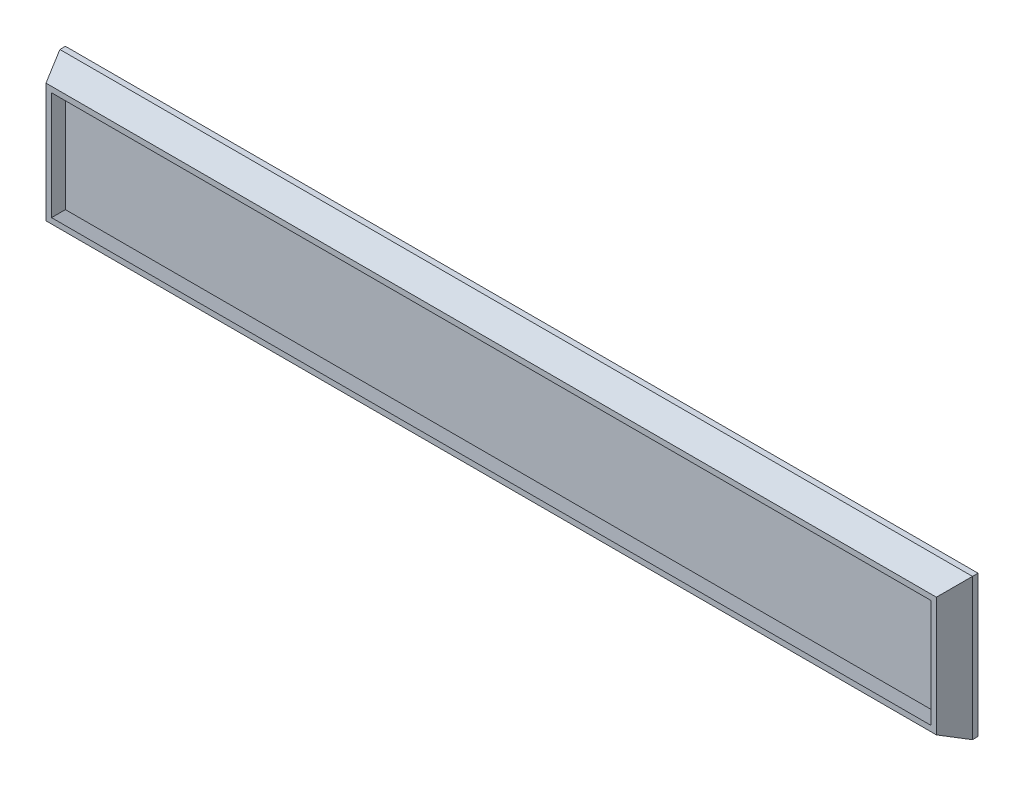
ISO-10303-21;
HEADER;
FILE_DESCRIPTION(('STEP AP214'),'2;1');
FILE_NAME('part.step','',(''),(''),'','','');
FILE_SCHEMA(('AUTOMOTIVE_DESIGN { 1 0 10303 214 1 1 1 1 }'));
ENDSEC;
DATA;
#1=APPLICATION_CONTEXT('core data for automotive mechanical design processes');
#2=APPLICATION_PROTOCOL_DEFINITION('international standard','automotive_design',2000,#1);
#3=PRODUCT_CONTEXT('',#1,'mechanical');
#4=PRODUCT('Part','Part','',(#3));
#5=PRODUCT_RELATED_PRODUCT_CATEGORY('part','',(#4));
#6=PRODUCT_DEFINITION_FORMATION('','',#4);
#7=PRODUCT_DEFINITION_CONTEXT('part definition',#1,'design');
#8=PRODUCT_DEFINITION('design','',#6,#7);
#9=PRODUCT_DEFINITION_SHAPE('','',#8);
#10=(LENGTH_UNIT() NAMED_UNIT(*) SI_UNIT(.MILLI.,.METRE.));
#11=(NAMED_UNIT(*) PLANE_ANGLE_UNIT() SI_UNIT($,.RADIAN.));
#12=(NAMED_UNIT(*) SI_UNIT($,.STERADIAN.) SOLID_ANGLE_UNIT());
#13=UNCERTAINTY_MEASURE_WITH_UNIT(LENGTH_MEASURE(1.E-05),#10,'distance_accuracy_value','');
#14=(GEOMETRIC_REPRESENTATION_CONTEXT(3) GLOBAL_UNCERTAINTY_ASSIGNED_CONTEXT((#13)) GLOBAL_UNIT_ASSIGNED_CONTEXT((#10,
#11,#12)) REPRESENTATION_CONTEXT('',''));
#15=CARTESIAN_POINT('',(0.,0.,0.));
#16=DIRECTION('',(0.,0.,1.));
#17=DIRECTION('',(1.,0.,0.));
#18=AXIS2_PLACEMENT_3D('',#15,#16,#17);
#19=CARTESIAN_POINT('',(82.25,-12.75,1.));
#20=DIRECTION('',(-1.,0.,0.));
#21=DIRECTION('',(0.,0.,1.));
#22=AXIS2_PLACEMENT_3D('',#19,#20,#21);
#23=PLANE('',#22);
#24=DIRECTION('',(0.,1.,0.));
#25=VECTOR('',#24,1.);
#26=CARTESIAN_POINT('',(82.25,-12.75,0.));
#27=LINE('',#26,#25);
#28=CARTESIAN_POINT('',(82.25,-12.75,0.));
#29=VERTEX_POINT('',#28);
#30=CARTESIAN_POINT('',(82.25,12.75,0.));
#31=VERTEX_POINT('',#30);
#32=EDGE_CURVE('E134',#29,#31,#27,.T.);
#33=ORIENTED_EDGE('',*,*,#32,.T.);
#34=DIRECTION('',(0.,0.,-1.));
#35=VECTOR('',#34,1.);
#36=CARTESIAN_POINT('',(82.25,12.75,1.));
#37=LINE('',#36,#35);
#38=CARTESIAN_POINT('',(82.25,12.75,0.999999999999992));
#39=VERTEX_POINT('',#38);
#40=EDGE_CURVE('E12',#39,#31,#37,.T.);
#41=ORIENTED_EDGE('',*,*,#40,.F.);
#42=DIRECTION('',(0.,1.,0.));
#43=VECTOR('',#42,1.);
#44=CARTESIAN_POINT('',(82.25,0.,0.999999999999984));
#45=LINE('',#44,#43);
#46=CARTESIAN_POINT('',(82.25,-12.75,0.999999999999993));
#47=VERTEX_POINT('',#46);
#48=EDGE_CURVE('E92',#47,#39,#45,.T.);
#49=ORIENTED_EDGE('',*,*,#48,.F.);
#50=DIRECTION('',(0.,0.,-1.));
#51=VECTOR('',#50,1.);
#52=CARTESIAN_POINT('',(82.25,-12.75,1.));
#53=LINE('',#52,#51);
#54=EDGE_CURVE('E551',#47,#29,#53,.T.);
#55=ORIENTED_EDGE('',*,*,#54,.T.);
#56=EDGE_LOOP('',(#33,#41,#49,#55));
#57=FACE_BOUND('',#56,.T.);
#58=ADVANCED_FACE('F51',(#57),#23,.F.);
#59=CARTESIAN_POINT('',(-82.25,12.75,1.));
#60=DIRECTION('',(0.,-1.,0.));
#61=DIRECTION('',(0.,0.,-1.));
#62=AXIS2_PLACEMENT_3D('',#59,#60,#61);
#63=PLANE('',#62);
#64=DIRECTION('',(-1.,0.,0.));
#65=VECTOR('',#64,1.);
#66=CARTESIAN_POINT('',(-82.25,12.75,0.));
#67=LINE('',#66,#65);
#68=CARTESIAN_POINT('',(-82.25,12.75,0.));
#69=VERTEX_POINT('',#68);
#70=EDGE_CURVE('E546',#31,#69,#67,.T.);
#71=ORIENTED_EDGE('',*,*,#70,.T.);
#72=DIRECTION('',(0.,0.,-1.));
#73=VECTOR('',#72,1.);
#74=CARTESIAN_POINT('',(-82.25,12.75,1.));
#75=LINE('',#74,#73);
#76=CARTESIAN_POINT('',(-82.25,12.75,0.999999999999992));
#77=VERTEX_POINT('',#76);
#78=EDGE_CURVE('E60',#77,#69,#75,.T.);
#79=ORIENTED_EDGE('',*,*,#78,.F.);
#80=DIRECTION('',(1.,0.,0.));
#81=VECTOR('',#80,1.);
#82=CARTESIAN_POINT('',(0.,12.75,0.999999999999997));
#83=LINE('',#82,#81);
#84=EDGE_CURVE('E124',#39,#77,#83,.F.);
#85=ORIENTED_EDGE('',*,*,#84,.F.);
#86=ORIENTED_EDGE('',*,*,#40,.T.);
#87=EDGE_LOOP('',(#71,#79,#85,#86));
#88=FACE_BOUND('',#87,.T.);
#89=ADVANCED_FACE('F125',(#88),#63,.F.);
#90=CARTESIAN_POINT('',(-82.25,-12.75,1.));
#91=DIRECTION('',(1.,0.,0.));
#92=DIRECTION('',(0.,0.,-1.));
#93=AXIS2_PLACEMENT_3D('',#90,#91,#92);
#94=PLANE('',#93);
#95=DIRECTION('',(0.,-1.,0.));
#96=VECTOR('',#95,1.);
#97=CARTESIAN_POINT('',(-82.25,-12.75,0.));
#98=LINE('',#97,#96);
#99=CARTESIAN_POINT('',(-82.25,-12.75,0.));
#100=VERTEX_POINT('',#99);
#101=EDGE_CURVE('E548',#69,#100,#98,.T.);
#102=ORIENTED_EDGE('',*,*,#101,.T.);
#103=DIRECTION('',(0.,0.,-1.));
#104=VECTOR('',#103,1.);
#105=CARTESIAN_POINT('',(-82.25,-12.75,1.));
#106=LINE('',#105,#104);
#107=CARTESIAN_POINT('',(-82.25,-12.75,0.999999999999993));
#108=VERTEX_POINT('',#107);
#109=EDGE_CURVE('E78',#108,#100,#106,.T.);
#110=ORIENTED_EDGE('',*,*,#109,.F.);
#111=DIRECTION('',(0.,1.,0.));
#112=VECTOR('',#111,1.);
#113=CARTESIAN_POINT('',(-82.25,0.,0.999999999999984));
#114=LINE('',#113,#112);
#115=EDGE_CURVE('E131',#77,#108,#114,.F.);
#116=ORIENTED_EDGE('',*,*,#115,.F.);
#117=ORIENTED_EDGE('',*,*,#78,.T.);
#118=EDGE_LOOP('',(#102,#110,#116,#117));
#119=FACE_BOUND('',#118,.T.);
#120=ADVANCED_FACE('F185',(#119),#94,.F.);
#121=CARTESIAN_POINT('',(-82.25,-12.75,1.));
#122=DIRECTION('',(0.,1.,0.));
#123=DIRECTION('',(0.,0.,1.));
#124=AXIS2_PLACEMENT_3D('',#121,#122,#123);
#125=PLANE('',#124);
#126=DIRECTION('',(1.,0.,0.));
#127=VECTOR('',#126,1.);
#128=CARTESIAN_POINT('',(-82.25,-12.75,0.));
#129=LINE('',#128,#127);
#130=EDGE_CURVE('E120',#100,#29,#129,.T.);
#131=ORIENTED_EDGE('',*,*,#130,.T.);
#132=ORIENTED_EDGE('',*,*,#54,.F.);
#133=DIRECTION('',(1.,0.,0.));
#134=VECTOR('',#133,1.);
#135=CARTESIAN_POINT('',(0.,-12.75,0.999999999999998));
#136=LINE('',#135,#134);
#137=EDGE_CURVE('E553',#108,#47,#136,.T.);
#138=ORIENTED_EDGE('',*,*,#137,.F.);
#139=ORIENTED_EDGE('',*,*,#109,.T.);
#140=EDGE_LOOP('',(#131,#132,#138,#139));
#141=FACE_BOUND('',#140,.T.);
#142=ADVANCED_FACE('F181',(#141),#125,.F.);
#143=CARTESIAN_POINT('',(0.,0.,0.));
#144=DIRECTION('',(0.,0.,-1.));
#145=DIRECTION('',(-1.,0.,0.));
#146=AXIS2_PLACEMENT_3D('',#143,#144,#145);
#147=PLANE('',#146);
#148=ORIENTED_EDGE('',*,*,#32,.F.);
#149=ORIENTED_EDGE('',*,*,#130,.F.);
#150=ORIENTED_EDGE('',*,*,#101,.F.);
#151=ORIENTED_EDGE('',*,*,#70,.F.);
#152=EDGE_LOOP('',(#148,#149,#150,#151));
#153=FACE_BOUND('',#152,.T.);
#154=ADVANCED_FACE('F177',(#153),#147,.T.);
#155=CARTESIAN_POINT('',(0.,0.,5.5));
#156=DIRECTION('',(0.,0.,1.));
#157=DIRECTION('',(1.,0.,0.));
#158=AXIS2_PLACEMENT_3D('',#155,#156,#157);
#159=PLANE('',#158);
#160=DIRECTION('',(0.,-1.,0.));
#161=VECTOR('',#160,1.);
#162=CARTESIAN_POINT('',(-79.25,9.75,5.5));
#163=LINE('',#162,#161);
#164=CARTESIAN_POINT('',(-79.25,9.75,5.5));
#165=VERTEX_POINT('',#164);
#166=CARTESIAN_POINT('',(-79.25,-9.75,5.5));
#167=VERTEX_POINT('',#166);
#168=EDGE_CURVE('E54',#165,#167,#163,.T.);
#169=ORIENTED_EDGE('',*,*,#168,.F.);
#170=DIRECTION('',(-1.,0.,0.));
#171=VECTOR('',#170,1.);
#172=CARTESIAN_POINT('',(79.25,9.75000000000003,5.5));
#173=LINE('',#172,#171);
#174=CARTESIAN_POINT('',(79.25,9.75000000000003,5.5));
#175=VERTEX_POINT('',#174);
#176=EDGE_CURVE('E418',#175,#165,#173,.T.);
#177=ORIENTED_EDGE('',*,*,#176,.F.);
#178=DIRECTION('',(0.,1.,0.));
#179=VECTOR('',#178,1.);
#180=CARTESIAN_POINT('',(79.25,-9.74999999999998,5.5));
#181=LINE('',#180,#179);
#182=CARTESIAN_POINT('',(79.25,-9.74999999999998,5.5));
#183=VERTEX_POINT('',#182);
#184=EDGE_CURVE('E405',#183,#175,#181,.T.);
#185=ORIENTED_EDGE('',*,*,#184,.F.);
#186=DIRECTION('',(1.,0.,0.));
#187=VECTOR('',#186,1.);
#188=CARTESIAN_POINT('',(-79.25,-9.74999999999999,5.5));
#189=LINE('',#188,#187);
#190=EDGE_CURVE('E68',#167,#183,#189,.T.);
#191=ORIENTED_EDGE('',*,*,#190,.F.);
#192=EDGE_LOOP('',(#169,#177,#185,#191));
#193=FACE_BOUND('',#192,.T.);
#194=DIRECTION('',(0.,-1.,0.));
#195=VECTOR('',#194,1.);
#196=CARTESIAN_POINT('',(-80.25,10.75,5.5));
#197=LINE('',#196,#195);
#198=CARTESIAN_POINT('',(-80.25,10.75,5.5));
#199=VERTEX_POINT('',#198);
#200=CARTESIAN_POINT('',(-80.25,-10.75,5.5));
#201=VERTEX_POINT('',#200);
#202=EDGE_CURVE('E397',#199,#201,#197,.T.);
#203=ORIENTED_EDGE('',*,*,#202,.T.);
#204=DIRECTION('',(1.,0.,0.));
#205=VECTOR('',#204,1.);
#206=CARTESIAN_POINT('',(-80.25,-10.75,5.5));
#207=LINE('',#206,#205);
#208=CARTESIAN_POINT('',(80.25,-10.75,5.5));
#209=VERTEX_POINT('',#208);
#210=EDGE_CURVE('E482',#201,#209,#207,.T.);
#211=ORIENTED_EDGE('',*,*,#210,.T.);
#212=DIRECTION('',(0.,1.,0.));
#213=VECTOR('',#212,1.);
#214=CARTESIAN_POINT('',(80.25,-10.75,5.5));
#215=LINE('',#214,#213);
#216=CARTESIAN_POINT('',(80.25,10.75,5.5));
#217=VERTEX_POINT('',#216);
#218=EDGE_CURVE('E104',#209,#217,#215,.T.);
#219=ORIENTED_EDGE('',*,*,#218,.T.);
#220=DIRECTION('',(-1.,0.,0.));
#221=VECTOR('',#220,1.);
#222=CARTESIAN_POINT('',(80.25,10.75,5.5));
#223=LINE('',#222,#221);
#224=EDGE_CURVE('E143',#217,#199,#223,.T.);
#225=ORIENTED_EDGE('',*,*,#224,.T.);
#226=EDGE_LOOP('',(#203,#211,#219,#225));
#227=FACE_BOUND('',#226,.T.);
#228=ADVANCED_FACE('F180',(#193,#227),#159,.T.);
#229=CARTESIAN_POINT('',(-69.0541237113402,0.,30.6907216494846));
#230=DIRECTION('',(-0.913811548620257,0.,0.406138466053448));
#231=DIRECTION('',(0.406138466053448,0.,0.913811548620257));
#232=AXIS2_PLACEMENT_3D('',#229,#230,#231);
#233=PLANE('',#232);
#234=DIRECTION('',(-0.376288347353439,0.376288347353439,-0.846648781545237));
#235=VECTOR('',#234,1.);
#236=CARTESIAN_POINT('',(-80.25,10.75,5.5));
#237=LINE('',#236,#235);
#238=EDGE_CURVE('E149',#199,#77,#237,.T.);
#239=ORIENTED_EDGE('',*,*,#238,.T.);
#240=ORIENTED_EDGE('',*,*,#115,.T.);
#241=DIRECTION('',(-0.376288347353439,-0.376288347353439,-0.846648781545237));
#242=VECTOR('',#241,1.);
#243=CARTESIAN_POINT('',(-80.25,-10.75,5.5));
#244=LINE('',#243,#242);
#245=EDGE_CURVE('E145',#201,#108,#244,.T.);
#246=ORIENTED_EDGE('',*,*,#245,.F.);
#247=ORIENTED_EDGE('',*,*,#202,.F.);
#248=EDGE_LOOP('',(#239,#240,#246,#247));
#249=FACE_BOUND('',#248,.T.);
#250=ADVANCED_FACE('F217',(#249),#233,.T.);
#251=CARTESIAN_POINT('',(0.,-11.0180412371134,4.89690721649485));
#252=DIRECTION('',(0.,-0.913811548620257,0.406138466053448));
#253=DIRECTION('',(0.,-0.406138466053448,-0.913811548620257));
#254=AXIS2_PLACEMENT_3D('',#251,#252,#253);
#255=PLANE('',#254);
#256=ORIENTED_EDGE('',*,*,#245,.T.);
#257=ORIENTED_EDGE('',*,*,#137,.T.);
#258=DIRECTION('',(0.376288347353439,-0.376288347353439,-0.846648781545237));
#259=VECTOR('',#258,1.);
#260=CARTESIAN_POINT('',(80.25,-10.75,5.5));
#261=LINE('',#260,#259);
#262=EDGE_CURVE('E139',#209,#47,#261,.T.);
#263=ORIENTED_EDGE('',*,*,#262,.F.);
#264=ORIENTED_EDGE('',*,*,#210,.F.);
#265=EDGE_LOOP('',(#256,#257,#263,#264));
#266=FACE_BOUND('',#265,.T.);
#267=ADVANCED_FACE('F222',(#266),#255,.T.);
#268=CARTESIAN_POINT('',(0.,11.0180412371134,4.89690721649485));
#269=DIRECTION('',(0.,0.913811548620257,0.406138466053448));
#270=DIRECTION('',(0.,-0.406138466053448,0.913811548620257));
#271=AXIS2_PLACEMENT_3D('',#268,#269,#270);
#272=PLANE('',#271);
#273=DIRECTION('',(0.376288347353439,0.376288347353439,-0.846648781545237));
#274=VECTOR('',#273,1.);
#275=CARTESIAN_POINT('',(80.25,10.75,5.5));
#276=LINE('',#275,#274);
#277=EDGE_CURVE('E137',#217,#39,#276,.T.);
#278=ORIENTED_EDGE('',*,*,#277,.T.);
#279=ORIENTED_EDGE('',*,*,#84,.T.);
#280=ORIENTED_EDGE('',*,*,#238,.F.);
#281=ORIENTED_EDGE('',*,*,#224,.F.);
#282=EDGE_LOOP('',(#278,#279,#280,#281));
#283=FACE_BOUND('',#282,.T.);
#284=ADVANCED_FACE('F141',(#283),#272,.T.);
#285=CARTESIAN_POINT('',(69.0541237113402,0.,30.6907216494846));
#286=DIRECTION('',(0.913811548620257,0.,0.406138466053448));
#287=DIRECTION('',(0.406138466053448,0.,-0.913811548620257));
#288=AXIS2_PLACEMENT_3D('',#285,#286,#287);
#289=PLANE('',#288);
#290=ORIENTED_EDGE('',*,*,#262,.T.);
#291=ORIENTED_EDGE('',*,*,#48,.T.);
#292=ORIENTED_EDGE('',*,*,#277,.F.);
#293=ORIENTED_EDGE('',*,*,#218,.F.);
#294=EDGE_LOOP('',(#290,#291,#292,#293));
#295=FACE_BOUND('',#294,.T.);
#296=ADVANCED_FACE('F135',(#295),#289,.T.);
#297=CARTESIAN_POINT('',(0.,0.,1.));
#298=DIRECTION('',(0.,0.,1.));
#299=DIRECTION('',(1.,0.,0.));
#300=AXIS2_PLACEMENT_3D('',#297,#298,#299);
#301=PLANE('',#300);
#302=DIRECTION('',(0.,-1.,0.));
#303=VECTOR('',#302,1.);
#304=CARTESIAN_POINT('',(-81.25,11.75,1.));
#305=LINE('',#304,#303);
#306=CARTESIAN_POINT('',(-81.25,11.75,1.));
#307=VERTEX_POINT('',#306);
#308=CARTESIAN_POINT('',(-81.25,-11.75,1.));
#309=VERTEX_POINT('',#308);
#310=EDGE_CURVE('E409',#307,#309,#305,.T.);
#311=ORIENTED_EDGE('',*,*,#310,.T.);
#312=DIRECTION('',(1.,0.,0.));
#313=VECTOR('',#312,1.);
#314=CARTESIAN_POINT('',(-81.25,-11.75,1.));
#315=LINE('',#314,#313);
#316=CARTESIAN_POINT('',(81.25,-11.75,1.));
#317=VERTEX_POINT('',#316);
#318=EDGE_CURVE('E330',#309,#317,#315,.T.);
#319=ORIENTED_EDGE('',*,*,#318,.T.);
#320=DIRECTION('',(0.,1.,0.));
#321=VECTOR('',#320,1.);
#322=CARTESIAN_POINT('',(81.25,-11.75,1.));
#323=LINE('',#322,#321);
#324=CARTESIAN_POINT('',(81.25,11.75,1.));
#325=VERTEX_POINT('',#324);
#326=EDGE_CURVE('E398',#317,#325,#323,.T.);
#327=ORIENTED_EDGE('',*,*,#326,.T.);
#328=DIRECTION('',(-1.,0.,0.));
#329=VECTOR('',#328,1.);
#330=CARTESIAN_POINT('',(81.25,11.75,1.));
#331=LINE('',#330,#329);
#332=EDGE_CURVE('E380',#325,#307,#331,.T.);
#333=ORIENTED_EDGE('',*,*,#332,.T.);
#334=EDGE_LOOP('',(#311,#319,#327,#333));
#335=FACE_BOUND('',#334,.T.);
#336=ADVANCED_FACE('F174',(#335),#301,.T.);
#337=CARTESIAN_POINT('',(-68.2190721649484,0.,30.319587628866));
#338=DIRECTION('',(-0.913811548620257,0.,0.406138466053448));
#339=DIRECTION('',(0.406138466053448,0.,0.913811548620257));
#340=AXIS2_PLACEMENT_3D('',#337,#338,#339);
#341=PLANE('',#340);
#342=DIRECTION('',(-0.376288347353439,0.376288347353439,-0.846648781545237));
#343=VECTOR('',#342,1.);
#344=CARTESIAN_POINT('',(-79.25,9.75,5.5));
#345=LINE('',#344,#343);
#346=EDGE_CURVE('E359',#165,#307,#345,.T.);
#347=ORIENTED_EDGE('',*,*,#346,.F.);
#348=ORIENTED_EDGE('',*,*,#168,.T.);
#349=DIRECTION('',(-0.376288347353439,-0.376288347353439,-0.846648781545237));
#350=VECTOR('',#349,1.);
#351=CARTESIAN_POINT('',(-79.25,-9.74999999999999,5.5));
#352=LINE('',#351,#350);
#353=EDGE_CURVE('E350',#167,#309,#352,.T.);
#354=ORIENTED_EDGE('',*,*,#353,.T.);
#355=ORIENTED_EDGE('',*,*,#310,.F.);
#356=EDGE_LOOP('',(#347,#348,#354,#355));
#357=FACE_BOUND('',#356,.T.);
#358=ADVANCED_FACE('F262',(#357),#341,.F.);
#359=CARTESIAN_POINT('',(0.,-10.1829896907216,4.52577319587629));
#360=DIRECTION('',(0.,-0.913811548620257,0.406138466053448));
#361=DIRECTION('',(0.,-0.406138466053448,-0.913811548620257));
#362=AXIS2_PLACEMENT_3D('',#359,#360,#361);
#363=PLANE('',#362);
#364=ORIENTED_EDGE('',*,*,#353,.F.);
#365=ORIENTED_EDGE('',*,*,#190,.T.);
#366=DIRECTION('',(0.376288347353439,-0.376288347353441,-0.846648781545237));
#367=VECTOR('',#366,1.);
#368=CARTESIAN_POINT('',(79.25,-9.74999999999998,5.5));
#369=LINE('',#368,#367);
#370=EDGE_CURVE('E407',#183,#317,#369,.T.);
#371=ORIENTED_EDGE('',*,*,#370,.T.);
#372=ORIENTED_EDGE('',*,*,#318,.F.);
#373=EDGE_LOOP('',(#364,#365,#371,#372));
#374=FACE_BOUND('',#373,.T.);
#375=ADVANCED_FACE('F272',(#374),#363,.F.);
#376=CARTESIAN_POINT('',(0.,10.1829896907217,4.52577319587624));
#377=DIRECTION('',(0.,0.913811548620259,0.406138466053443));
#378=DIRECTION('',(0.,-0.406138466053443,0.913811548620259));
#379=AXIS2_PLACEMENT_3D('',#376,#377,#378);
#380=PLANE('',#379);
#381=DIRECTION('',(0.37628834735344,0.376288347353434,-0.846648781545239));
#382=VECTOR('',#381,1.);
#383=CARTESIAN_POINT('',(79.25,9.75000000000003,5.5));
#384=LINE('',#383,#382);
#385=EDGE_CURVE('E358',#175,#325,#384,.T.);
#386=ORIENTED_EDGE('',*,*,#385,.F.);
#387=ORIENTED_EDGE('',*,*,#176,.T.);
#388=ORIENTED_EDGE('',*,*,#346,.T.);
#389=ORIENTED_EDGE('',*,*,#332,.F.);
#390=EDGE_LOOP('',(#386,#387,#388,#389));
#391=FACE_BOUND('',#390,.T.);
#392=ADVANCED_FACE('F282',(#391),#380,.F.);
#393=CARTESIAN_POINT('',(68.2190721649484,0.,30.319587628866));
#394=DIRECTION('',(0.913811548620257,0.,0.406138466053448));
#395=DIRECTION('',(0.406138466053448,0.,-0.913811548620257));
#396=AXIS2_PLACEMENT_3D('',#393,#394,#395);
#397=PLANE('',#396);
#398=ORIENTED_EDGE('',*,*,#370,.F.);
#399=ORIENTED_EDGE('',*,*,#184,.T.);
#400=ORIENTED_EDGE('',*,*,#385,.T.);
#401=ORIENTED_EDGE('',*,*,#326,.F.);
#402=EDGE_LOOP('',(#398,#399,#400,#401));
#403=FACE_BOUND('',#402,.T.);
#404=ADVANCED_FACE('F291',(#403),#397,.F.);
#405=CLOSED_SHELL('',(#58,#89,#120,#142,#154,#228,#250,#267,#284,#296,#336,#358,#375,#392,#404));
#406=MANIFOLD_SOLID_BREP('B2',#405);
#407=ADVANCED_BREP_SHAPE_REPRESENTATION('',(#18,#406),#14);
#408=SHAPE_DEFINITION_REPRESENTATION(#9,#407);
ENDSEC;
END-ISO-10303-21;
